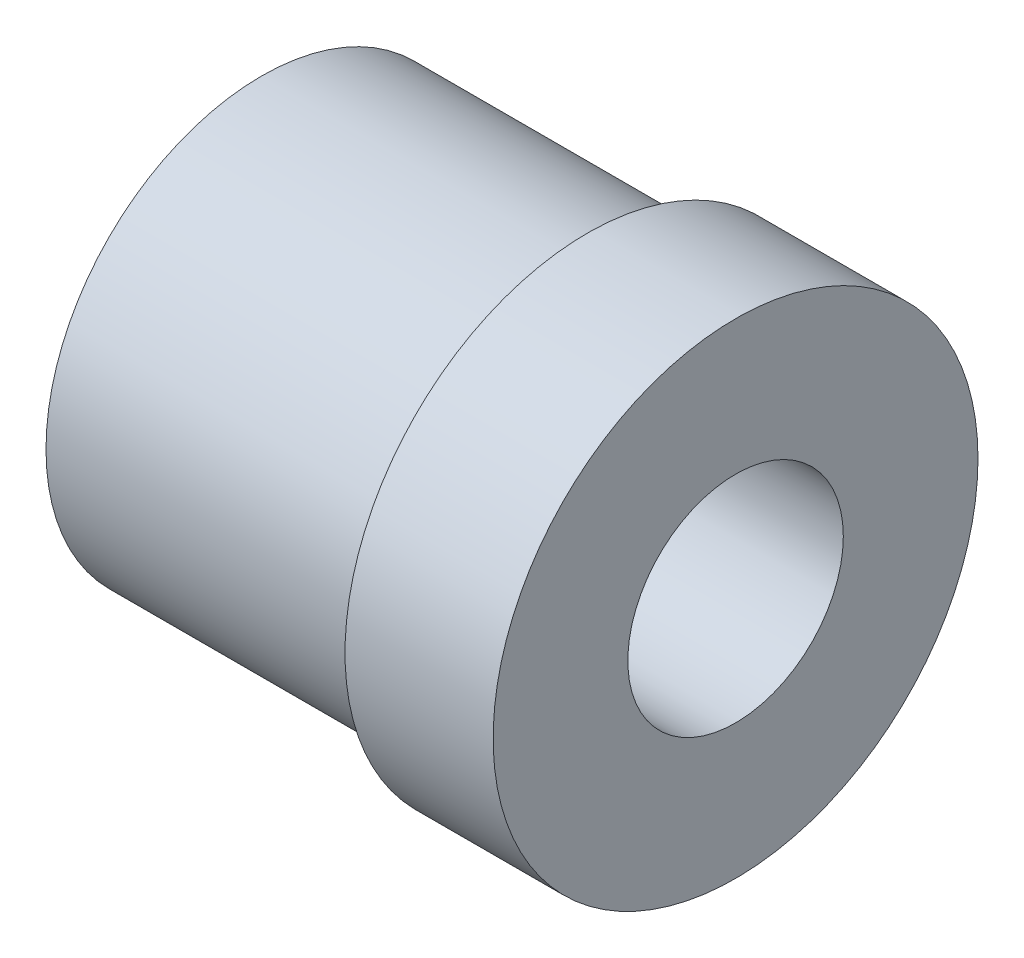
ISO-10303-21;
HEADER;
FILE_DESCRIPTION(('STEP AP214'),'2;1');
FILE_NAME('part.step','',(''),(''),'','','');
FILE_SCHEMA(('AUTOMOTIVE_DESIGN { 1 0 10303 214 1 1 1 1 }'));
ENDSEC;
DATA;
#1=APPLICATION_CONTEXT('core data for automotive mechanical design processes');
#2=APPLICATION_PROTOCOL_DEFINITION('international standard','automotive_design',2000,#1);
#3=PRODUCT_CONTEXT('',#1,'mechanical');
#4=PRODUCT('Part','Part','',(#3));
#5=PRODUCT_RELATED_PRODUCT_CATEGORY('part','',(#4));
#6=PRODUCT_DEFINITION_FORMATION('','',#4);
#7=PRODUCT_DEFINITION_CONTEXT('part definition',#1,'design');
#8=PRODUCT_DEFINITION('design','',#6,#7);
#9=PRODUCT_DEFINITION_SHAPE('','',#8);
#10=(LENGTH_UNIT() NAMED_UNIT(*) SI_UNIT(.MILLI.,.METRE.));
#11=(NAMED_UNIT(*) PLANE_ANGLE_UNIT() SI_UNIT($,.RADIAN.));
#12=(NAMED_UNIT(*) SI_UNIT($,.STERADIAN.) SOLID_ANGLE_UNIT());
#13=UNCERTAINTY_MEASURE_WITH_UNIT(LENGTH_MEASURE(1.E-05),#10,'distance_accuracy_value','');
#14=(GEOMETRIC_REPRESENTATION_CONTEXT(3) GLOBAL_UNCERTAINTY_ASSIGNED_CONTEXT((#13)) GLOBAL_UNIT_ASSIGNED_CONTEXT((#10,
#11,#12)) REPRESENTATION_CONTEXT('',''));
#15=CARTESIAN_POINT('',(0.,0.,0.));
#16=DIRECTION('',(0.,0.,1.));
#17=DIRECTION('',(1.,0.,0.));
#18=AXIS2_PLACEMENT_3D('',#15,#16,#17);
#19=CARTESIAN_POINT('',(6.05,0.,0.));
#20=DIRECTION('',(1.,0.,0.));
#21=DIRECTION('',(0.,1.,0.));
#22=AXIS2_PLACEMENT_3D('',#19,#20,#21);
#23=PLANE('',#22);
#24=CARTESIAN_POINT('',(6.05,0.,0.));
#25=DIRECTION('',(1.,0.,0.));
#26=DIRECTION('',(0.,0.,-1.));
#27=AXIS2_PLACEMENT_3D('',#24,#25,#26);
#28=CIRCLE('',#27,9.);
#29=CARTESIAN_POINT('',(6.05,0.,-9.));
#30=VERTEX_POINT('',#29);
#31=EDGE_CURVE('E26',#30,#30,#28,.T.);
#32=ORIENTED_EDGE('',*,*,#31,.F.);
#33=EDGE_LOOP('',(#32));
#34=FACE_BOUND('',#33,.T.);
#35=CARTESIAN_POINT('',(6.05,0.,0.));
#36=DIRECTION('',(1.,0.,0.));
#37=DIRECTION('',(0.,0.,-1.));
#38=AXIS2_PLACEMENT_3D('',#35,#36,#37);
#39=CIRCLE('',#38,8.);
#40=CARTESIAN_POINT('',(6.05,0.,-8.));
#41=VERTEX_POINT('',#40);
#42=EDGE_CURVE('E68',#41,#41,#39,.T.);
#43=ORIENTED_EDGE('',*,*,#42,.T.);
#44=EDGE_LOOP('',(#43));
#45=FACE_BOUND('',#44,.T.);
#46=ADVANCED_FACE('F17',(#34,#45),#23,.F.);
#47=CARTESIAN_POINT('',(11.55,0.,0.));
#48=DIRECTION('',(1.,0.,0.));
#49=DIRECTION('',(0.,1.,0.));
#50=AXIS2_PLACEMENT_3D('',#47,#48,#49);
#51=PLANE('',#50);
#52=CARTESIAN_POINT('',(11.55,0.,0.));
#53=DIRECTION('',(1.,0.,0.));
#54=DIRECTION('',(0.,0.,-1.));
#55=AXIS2_PLACEMENT_3D('',#52,#53,#54);
#56=CIRCLE('',#55,4.);
#57=CARTESIAN_POINT('',(11.55,0.,-4.));
#58=VERTEX_POINT('',#57);
#59=EDGE_CURVE('E48',#58,#58,#56,.T.);
#60=ORIENTED_EDGE('',*,*,#59,.F.);
#61=EDGE_LOOP('',(#60));
#62=FACE_BOUND('',#61,.T.);
#63=CARTESIAN_POINT('',(11.55,0.,0.));
#64=DIRECTION('',(1.,0.,0.));
#65=DIRECTION('',(0.,0.,-1.));
#66=AXIS2_PLACEMENT_3D('',#63,#64,#65);
#67=CIRCLE('',#66,9.);
#68=CARTESIAN_POINT('',(11.55,0.,-9.));
#69=VERTEX_POINT('',#68);
#70=EDGE_CURVE('E11',#69,#69,#67,.T.);
#71=ORIENTED_EDGE('',*,*,#70,.T.);
#72=EDGE_LOOP('',(#71));
#73=FACE_BOUND('',#72,.T.);
#74=ADVANCED_FACE('F91',(#62,#73),#51,.T.);
#75=CARTESIAN_POINT('',(10.55,0.,0.));
#76=DIRECTION('',(-1.,0.,0.));
#77=DIRECTION('',(0.,0.,1.));
#78=AXIS2_PLACEMENT_3D('',#75,#76,#77);
#79=CYLINDRICAL_SURFACE('',#78,9.);
#80=ORIENTED_EDGE('',*,*,#70,.F.);
#81=EDGE_LOOP('',(#80));
#82=FACE_BOUND('',#81,.T.);
#83=ORIENTED_EDGE('',*,*,#31,.T.);
#84=EDGE_LOOP('',(#83));
#85=FACE_BOUND('',#84,.T.);
#86=ADVANCED_FACE('F85',(#82,#85),#79,.T.);
#87=CARTESIAN_POINT('',(-6.05,0.,0.));
#88=DIRECTION('',(1.,0.,0.));
#89=DIRECTION('',(0.,1.,0.));
#90=AXIS2_PLACEMENT_3D('',#87,#88,#89);
#91=PLANE('',#90);
#92=CARTESIAN_POINT('',(-6.05,0.,0.));
#93=DIRECTION('',(1.,0.,0.));
#94=DIRECTION('',(0.,0.,-1.));
#95=AXIS2_PLACEMENT_3D('',#92,#93,#94);
#96=CIRCLE('',#95,4.);
#97=CARTESIAN_POINT('',(-6.05,0.,-4.));
#98=VERTEX_POINT('',#97);
#99=EDGE_CURVE('E57',#98,#98,#96,.T.);
#100=ORIENTED_EDGE('',*,*,#99,.T.);
#101=EDGE_LOOP('',(#100));
#102=FACE_BOUND('',#101,.T.);
#103=CARTESIAN_POINT('',(-6.05,0.,0.));
#104=DIRECTION('',(-1.,0.,0.));
#105=DIRECTION('',(0.,0.,-1.));
#106=AXIS2_PLACEMENT_3D('',#103,#104,#105);
#107=CIRCLE('',#106,8.);
#108=CARTESIAN_POINT('',(-6.05,0.,-8.));
#109=VERTEX_POINT('',#108);
#110=EDGE_CURVE('E65',#109,#109,#107,.T.);
#111=ORIENTED_EDGE('',*,*,#110,.T.);
#112=EDGE_LOOP('',(#111));
#113=FACE_BOUND('',#112,.T.);
#114=ADVANCED_FACE('F58',(#102,#113),#91,.F.);
#115=CARTESIAN_POINT('',(-6.05,0.,0.));
#116=DIRECTION('',(1.,0.,0.));
#117=DIRECTION('',(0.,0.,-1.));
#118=AXIS2_PLACEMENT_3D('',#115,#116,#117);
#119=CYLINDRICAL_SURFACE('',#118,8.);
#120=ORIENTED_EDGE('',*,*,#42,.F.);
#121=EDGE_LOOP('',(#120));
#122=FACE_BOUND('',#121,.T.);
#123=ORIENTED_EDGE('',*,*,#110,.F.);
#124=EDGE_LOOP('',(#123));
#125=FACE_BOUND('',#124,.T.);
#126=ADVANCED_FACE('F78',(#122,#125),#119,.T.);
#127=CARTESIAN_POINT('',(10.55,0.,0.));
#128=DIRECTION('',(-1.,0.,0.));
#129=DIRECTION('',(0.,0.,1.));
#130=AXIS2_PLACEMENT_3D('',#127,#128,#129);
#131=CYLINDRICAL_SURFACE('',#130,4.);
#132=ORIENTED_EDGE('',*,*,#59,.T.);
#133=EDGE_LOOP('',(#132));
#134=FACE_BOUND('',#133,.T.);
#135=ORIENTED_EDGE('',*,*,#99,.F.);
#136=EDGE_LOOP('',(#135));
#137=FACE_BOUND('',#136,.T.);
#138=ADVANCED_FACE('F81',(#134,#137),#131,.F.);
#139=CLOSED_SHELL('',(#46,#74,#86,#114,#126,#138));
#140=MANIFOLD_SOLID_BREP('B1',#139);
#141=ADVANCED_BREP_SHAPE_REPRESENTATION('',(#18,#140),#14);
#142=SHAPE_DEFINITION_REPRESENTATION(#9,#141);
ENDSEC;
END-ISO-10303-21;
